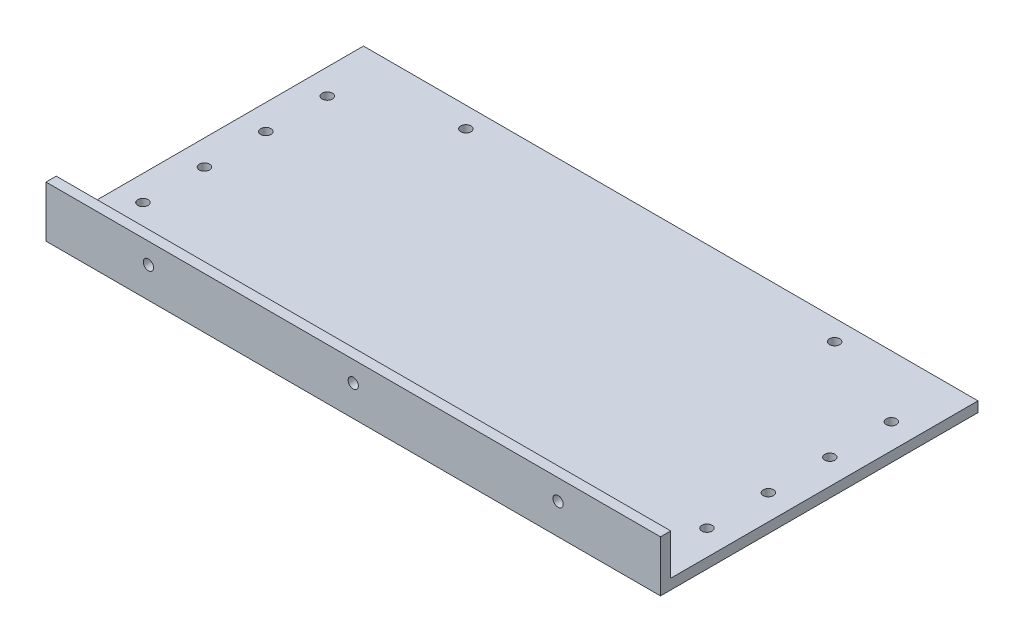
ISO-10303-21;
HEADER;
FILE_DESCRIPTION(('STEP AP214'),'2;1');
FILE_NAME('part.step','',(''),(''),'','','');
FILE_SCHEMA(('AUTOMOTIVE_DESIGN { 1 0 10303 214 1 1 1 1 }'));
ENDSEC;
DATA;
#1=APPLICATION_CONTEXT('core data for automotive mechanical design processes');
#2=APPLICATION_PROTOCOL_DEFINITION('international standard','automotive_design',2000,#1);
#3=PRODUCT_CONTEXT('',#1,'mechanical');
#4=PRODUCT('Part','Part','',(#3));
#5=PRODUCT_RELATED_PRODUCT_CATEGORY('part','',(#4));
#6=PRODUCT_DEFINITION_FORMATION('','',#4);
#7=PRODUCT_DEFINITION_CONTEXT('part definition',#1,'design');
#8=PRODUCT_DEFINITION('design','',#6,#7);
#9=PRODUCT_DEFINITION_SHAPE('','',#8);
#10=(LENGTH_UNIT() NAMED_UNIT(*) SI_UNIT(.MILLI.,.METRE.));
#11=(NAMED_UNIT(*) PLANE_ANGLE_UNIT() SI_UNIT($,.RADIAN.));
#12=(NAMED_UNIT(*) SI_UNIT($,.STERADIAN.) SOLID_ANGLE_UNIT());
#13=UNCERTAINTY_MEASURE_WITH_UNIT(LENGTH_MEASURE(1.E-05),#10,'distance_accuracy_value','');
#14=(GEOMETRIC_REPRESENTATION_CONTEXT(3) GLOBAL_UNCERTAINTY_ASSIGNED_CONTEXT((#13)) GLOBAL_UNIT_ASSIGNED_CONTEXT((#10,
#11,#12)) REPRESENTATION_CONTEXT('',''));
#15=CARTESIAN_POINT('',(0.,0.,0.));
#16=DIRECTION('',(0.,0.,1.));
#17=DIRECTION('',(1.,0.,0.));
#18=AXIS2_PLACEMENT_3D('',#15,#16,#17);
#19=CARTESIAN_POINT('',(-190.5,6.35,95.25));
#20=DIRECTION('',(1.,0.,0.));
#21=DIRECTION('',(0.,0.,-1.));
#22=AXIS2_PLACEMENT_3D('',#19,#20,#21);
#23=PLANE('',#22);
#24=DIRECTION('',(0.,0.,1.));
#25=VECTOR('',#24,1.);
#26=CARTESIAN_POINT('',(-190.5,0.,95.25));
#27=LINE('',#26,#25);
#28=CARTESIAN_POINT('',(-190.5,0.,-95.25));
#29=VERTEX_POINT('',#28);
#30=CARTESIAN_POINT('',(-190.5,0.,101.6));
#31=VERTEX_POINT('',#30);
#32=EDGE_CURVE('E103',#29,#31,#27,.T.);
#33=ORIENTED_EDGE('',*,*,#32,.T.);
#34=DIRECTION('',(0.,-1.,0.));
#35=VECTOR('',#34,1.);
#36=CARTESIAN_POINT('',(-190.5,0.,101.6));
#37=LINE('',#36,#35);
#38=CARTESIAN_POINT('',(-190.5,31.75,101.6));
#39=VERTEX_POINT('',#38);
#40=EDGE_CURVE('E127',#39,#31,#37,.T.);
#41=ORIENTED_EDGE('',*,*,#40,.F.);
#42=DIRECTION('',(0.,0.,-1.));
#43=VECTOR('',#42,1.);
#44=CARTESIAN_POINT('',(-190.5,31.75,101.6));
#45=LINE('',#44,#43);
#46=CARTESIAN_POINT('',(-190.5,31.75,95.25));
#47=VERTEX_POINT('',#46);
#48=EDGE_CURVE('E142',#39,#47,#45,.T.);
#49=ORIENTED_EDGE('',*,*,#48,.T.);
#50=DIRECTION('',(0.,-1.,0.));
#51=VECTOR('',#50,1.);
#52=CARTESIAN_POINT('',(-190.5,0.,95.25));
#53=LINE('',#52,#51);
#54=CARTESIAN_POINT('',(-190.5,6.35,95.25));
#55=VERTEX_POINT('',#54);
#56=EDGE_CURVE('E91',#47,#55,#53,.T.);
#57=ORIENTED_EDGE('',*,*,#56,.T.);
#58=DIRECTION('',(0.,0.,1.));
#59=VECTOR('',#58,1.);
#60=CARTESIAN_POINT('',(-190.5,6.35,95.25));
#61=LINE('',#60,#59);
#62=CARTESIAN_POINT('',(-190.5,6.35,-95.25));
#63=VERTEX_POINT('',#62);
#64=EDGE_CURVE('E96',#63,#55,#61,.T.);
#65=ORIENTED_EDGE('',*,*,#64,.F.);
#66=DIRECTION('',(0.,-1.,0.));
#67=VECTOR('',#66,1.);
#68=CARTESIAN_POINT('',(-190.5,6.35,-95.25));
#69=LINE('',#68,#67);
#70=EDGE_CURVE('E44',#63,#29,#69,.T.);
#71=ORIENTED_EDGE('',*,*,#70,.T.);
#72=EDGE_LOOP('',(#33,#41,#49,#57,#65,#71));
#73=FACE_BOUND('',#72,.T.);
#74=ADVANCED_FACE('F36',(#73),#23,.F.);
#75=CARTESIAN_POINT('',(190.5,6.35,95.25));
#76=DIRECTION('',(-1.,0.,0.));
#77=DIRECTION('',(0.,0.,1.));
#78=AXIS2_PLACEMENT_3D('',#75,#76,#77);
#79=PLANE('',#78);
#80=DIRECTION('',(0.,0.,-1.));
#81=VECTOR('',#80,1.);
#82=CARTESIAN_POINT('',(190.5,0.,95.25));
#83=LINE('',#82,#81);
#84=CARTESIAN_POINT('',(190.5,0.,101.6));
#85=VERTEX_POINT('',#84);
#86=CARTESIAN_POINT('',(190.5,0.,-95.25));
#87=VERTEX_POINT('',#86);
#88=EDGE_CURVE('E64',#85,#87,#83,.T.);
#89=ORIENTED_EDGE('',*,*,#88,.T.);
#90=DIRECTION('',(0.,-1.,0.));
#91=VECTOR('',#90,1.);
#92=CARTESIAN_POINT('',(190.5,6.35,-95.25));
#93=LINE('',#92,#91);
#94=CARTESIAN_POINT('',(190.5,6.35,-95.25));
#95=VERTEX_POINT('',#94);
#96=EDGE_CURVE('E11',#95,#87,#93,.T.);
#97=ORIENTED_EDGE('',*,*,#96,.F.);
#98=DIRECTION('',(0.,0.,-1.));
#99=VECTOR('',#98,1.);
#100=CARTESIAN_POINT('',(190.5,6.35,95.25));
#101=LINE('',#100,#99);
#102=CARTESIAN_POINT('',(190.5,6.35,95.25));
#103=VERTEX_POINT('',#102);
#104=EDGE_CURVE('E94',#103,#95,#101,.T.);
#105=ORIENTED_EDGE('',*,*,#104,.F.);
#106=DIRECTION('',(0.,1.,0.));
#107=VECTOR('',#106,1.);
#108=CARTESIAN_POINT('',(190.5,0.,95.25));
#109=LINE('',#108,#107);
#110=CARTESIAN_POINT('',(190.5,31.75,95.25));
#111=VERTEX_POINT('',#110);
#112=EDGE_CURVE('E83',#103,#111,#109,.T.);
#113=ORIENTED_EDGE('',*,*,#112,.T.);
#114=DIRECTION('',(0.,0.,-1.));
#115=VECTOR('',#114,1.);
#116=CARTESIAN_POINT('',(190.5,31.75,101.6));
#117=LINE('',#116,#115);
#118=CARTESIAN_POINT('',(190.5,31.75,101.6));
#119=VERTEX_POINT('',#118);
#120=EDGE_CURVE('E106',#119,#111,#117,.T.);
#121=ORIENTED_EDGE('',*,*,#120,.F.);
#122=DIRECTION('',(0.,1.,0.));
#123=VECTOR('',#122,1.);
#124=CARTESIAN_POINT('',(190.5,0.,101.6));
#125=LINE('',#124,#123);
#126=EDGE_CURVE('E126',#85,#119,#125,.T.);
#127=ORIENTED_EDGE('',*,*,#126,.F.);
#128=EDGE_LOOP('',(#89,#97,#105,#113,#121,#127));
#129=FACE_BOUND('',#128,.T.);
#130=ADVANCED_FACE('F98',(#129),#79,.F.);
#131=CARTESIAN_POINT('',(-190.5,6.35,-95.25));
#132=DIRECTION('',(0.,0.,1.));
#133=DIRECTION('',(1.,0.,0.));
#134=AXIS2_PLACEMENT_3D('',#131,#132,#133);
#135=PLANE('',#134);
#136=DIRECTION('',(-1.,0.,0.));
#137=VECTOR('',#136,1.);
#138=CARTESIAN_POINT('',(-190.5,0.,-95.25));
#139=LINE('',#138,#137);
#140=EDGE_CURVE('E108',#87,#29,#139,.T.);
#141=ORIENTED_EDGE('',*,*,#140,.T.);
#142=ORIENTED_EDGE('',*,*,#70,.F.);
#143=DIRECTION('',(-1.,0.,0.));
#144=VECTOR('',#143,1.);
#145=CARTESIAN_POINT('',(-190.5,6.35,-95.25));
#146=LINE('',#145,#144);
#147=EDGE_CURVE('E52',#95,#63,#146,.T.);
#148=ORIENTED_EDGE('',*,*,#147,.F.);
#149=ORIENTED_EDGE('',*,*,#96,.T.);
#150=EDGE_LOOP('',(#141,#142,#148,#149));
#151=FACE_BOUND('',#150,.T.);
#152=ADVANCED_FACE('F165',(#151),#135,.F.);
#153=CARTESIAN_POINT('',(0.,6.35,0.));
#154=DIRECTION('',(0.,-1.,0.));
#155=DIRECTION('',(0.,0.,-1.));
#156=AXIS2_PLACEMENT_3D('',#153,#154,#155);
#157=PLANE('',#156);
#158=CARTESIAN_POINT('',(174.8536,6.35,19.0500000000001));
#159=DIRECTION('',(0.,-1.,0.));
#160=DIRECTION('',(0.,0.,-1.));
#161=AXIS2_PLACEMENT_3D('',#158,#159,#160);
#162=CIRCLE('',#161,3.17499999999997);
#163=CARTESIAN_POINT('',(174.8536,6.35,15.8750000000001));
#164=VERTEX_POINT('',#163);
#165=EDGE_CURVE('E180',#164,#164,#162,.F.);
#166=ORIENTED_EDGE('',*,*,#165,.F.);
#167=EDGE_LOOP('',(#166));
#168=FACE_BOUND('',#167,.T.);
#169=CARTESIAN_POINT('',(-174.8536,6.35,19.0500000000001));
#170=DIRECTION('',(0.,-1.,0.));
#171=DIRECTION('',(0.,0.,-1.));
#172=AXIS2_PLACEMENT_3D('',#169,#170,#171);
#173=CIRCLE('',#172,3.17499999999997);
#174=CARTESIAN_POINT('',(-174.8536,6.35,15.8750000000001));
#175=VERTEX_POINT('',#174);
#176=EDGE_CURVE('E184',#175,#175,#173,.F.);
#177=ORIENTED_EDGE('',*,*,#176,.F.);
#178=EDGE_LOOP('',(#177));
#179=FACE_BOUND('',#178,.T.);
#180=CARTESIAN_POINT('',(-174.8536,6.35,-19.0499999999999));
#181=DIRECTION('',(0.,-1.,0.));
#182=DIRECTION('',(0.,0.,-1.));
#183=AXIS2_PLACEMENT_3D('',#180,#181,#182);
#184=CIRCLE('',#183,3.17499999999997);
#185=CARTESIAN_POINT('',(-174.8536,6.35,-22.2249999999999));
#186=VERTEX_POINT('',#185);
#187=EDGE_CURVE('E188',#186,#186,#184,.F.);
#188=ORIENTED_EDGE('',*,*,#187,.F.);
#189=EDGE_LOOP('',(#188));
#190=FACE_BOUND('',#189,.T.);
#191=CARTESIAN_POINT('',(174.8536,6.35,57.1500000000001));
#192=DIRECTION('',(0.,-1.,0.));
#193=DIRECTION('',(0.,0.,-1.));
#194=AXIS2_PLACEMENT_3D('',#191,#192,#193);
#195=CIRCLE('',#194,3.17499999999997);
#196=CARTESIAN_POINT('',(174.8536,6.35,53.9750000000001));
#197=VERTEX_POINT('',#196);
#198=EDGE_CURVE('E192',#197,#197,#195,.F.);
#199=ORIENTED_EDGE('',*,*,#198,.F.);
#200=EDGE_LOOP('',(#199));
#201=FACE_BOUND('',#200,.T.);
#202=CARTESIAN_POINT('',(174.8536,6.35,-19.0499999999999));
#203=DIRECTION('',(0.,-1.,0.));
#204=DIRECTION('',(0.,0.,-1.));
#205=AXIS2_PLACEMENT_3D('',#202,#203,#204);
#206=CIRCLE('',#205,3.17499999999997);
#207=CARTESIAN_POINT('',(174.8536,6.35,-22.2249999999999));
#208=VERTEX_POINT('',#207);
#209=EDGE_CURVE('E196',#208,#208,#206,.F.);
#210=ORIENTED_EDGE('',*,*,#209,.F.);
#211=EDGE_LOOP('',(#210));
#212=FACE_BOUND('',#211,.T.);
#213=CARTESIAN_POINT('',(174.8536,6.35,-57.1499999999999));
#214=DIRECTION('',(0.,-1.,0.));
#215=DIRECTION('',(0.,0.,-1.));
#216=AXIS2_PLACEMENT_3D('',#213,#214,#215);
#217=CIRCLE('',#216,3.17499999999997);
#218=CARTESIAN_POINT('',(174.8536,6.35,-60.3249999999999));
#219=VERTEX_POINT('',#218);
#220=EDGE_CURVE('E200',#219,#219,#217,.F.);
#221=ORIENTED_EDGE('',*,*,#220,.F.);
#222=EDGE_LOOP('',(#221));
#223=FACE_BOUND('',#222,.T.);
#224=CARTESIAN_POINT('',(-174.8536,6.35,57.1500000000001));
#225=DIRECTION('',(0.,-1.,0.));
#226=DIRECTION('',(0.,0.,-1.));
#227=AXIS2_PLACEMENT_3D('',#224,#225,#226);
#228=CIRCLE('',#227,3.17499999999997);
#229=CARTESIAN_POINT('',(-174.8536,6.35,53.9750000000001));
#230=VERTEX_POINT('',#229);
#231=EDGE_CURVE('E204',#230,#230,#228,.F.);
#232=ORIENTED_EDGE('',*,*,#231,.F.);
#233=EDGE_LOOP('',(#232));
#234=FACE_BOUND('',#233,.T.);
#235=CARTESIAN_POINT('',(-174.8536,6.35,-57.1499999999999));
#236=DIRECTION('',(0.,-1.,0.));
#237=DIRECTION('',(0.,0.,-1.));
#238=AXIS2_PLACEMENT_3D('',#235,#236,#237);
#239=CIRCLE('',#238,3.17499999999997);
#240=CARTESIAN_POINT('',(-174.8536,6.35,-60.3249999999999));
#241=VERTEX_POINT('',#240);
#242=EDGE_CURVE('E208',#241,#241,#239,.F.);
#243=ORIENTED_EDGE('',*,*,#242,.F.);
#244=EDGE_LOOP('',(#243));
#245=FACE_BOUND('',#244,.T.);
#246=CARTESIAN_POINT('',(114.3,6.35,-82.55));
#247=DIRECTION('',(0.,-1.,0.));
#248=DIRECTION('',(0.,0.,-1.));
#249=AXIS2_PLACEMENT_3D('',#246,#247,#248);
#250=CIRCLE('',#249,3.175);
#251=CARTESIAN_POINT('',(114.3,6.35,-85.725));
#252=VERTEX_POINT('',#251);
#253=EDGE_CURVE('E212',#252,#252,#250,.F.);
#254=ORIENTED_EDGE('',*,*,#253,.F.);
#255=EDGE_LOOP('',(#254));
#256=FACE_BOUND('',#255,.T.);
#257=CARTESIAN_POINT('',(-114.3,6.35,-82.55));
#258=DIRECTION('',(0.,-1.,0.));
#259=DIRECTION('',(0.,0.,-1.));
#260=AXIS2_PLACEMENT_3D('',#257,#258,#259);
#261=CIRCLE('',#260,3.175);
#262=CARTESIAN_POINT('',(-114.3,6.35,-85.725));
#263=VERTEX_POINT('',#262);
#264=EDGE_CURVE('E216',#263,#263,#261,.F.);
#265=ORIENTED_EDGE('',*,*,#264,.F.);
#266=EDGE_LOOP('',(#265));
#267=FACE_BOUND('',#266,.T.);
#268=CARTESIAN_POINT('',(114.3,6.35,82.55));
#269=DIRECTION('',(0.,-1.,0.));
#270=DIRECTION('',(0.,0.,-1.));
#271=AXIS2_PLACEMENT_3D('',#268,#269,#270);
#272=CIRCLE('',#271,3.175);
#273=CARTESIAN_POINT('',(114.3,6.35,79.375));
#274=VERTEX_POINT('',#273);
#275=EDGE_CURVE('E220',#274,#274,#272,.F.);
#276=ORIENTED_EDGE('',*,*,#275,.F.);
#277=EDGE_LOOP('',(#276));
#278=FACE_BOUND('',#277,.T.);
#279=CARTESIAN_POINT('',(-114.3,6.35,82.55));
#280=DIRECTION('',(0.,-1.,0.));
#281=DIRECTION('',(0.,0.,-1.));
#282=AXIS2_PLACEMENT_3D('',#279,#280,#281);
#283=CIRCLE('',#282,3.175);
#284=CARTESIAN_POINT('',(-114.3,6.35,79.375));
#285=VERTEX_POINT('',#284);
#286=EDGE_CURVE('E224',#285,#285,#283,.F.);
#287=ORIENTED_EDGE('',*,*,#286,.F.);
#288=EDGE_LOOP('',(#287));
#289=FACE_BOUND('',#288,.T.);
#290=CARTESIAN_POINT('',(0.,6.35,82.55));
#291=DIRECTION('',(0.,-1.,0.));
#292=DIRECTION('',(0.,0.,-1.));
#293=AXIS2_PLACEMENT_3D('',#290,#291,#292);
#294=CIRCLE('',#293,3.175);
#295=CARTESIAN_POINT('',(0.,6.35,79.375));
#296=VERTEX_POINT('',#295);
#297=EDGE_CURVE('E227',#296,#296,#294,.F.);
#298=ORIENTED_EDGE('',*,*,#297,.F.);
#299=EDGE_LOOP('',(#298));
#300=FACE_BOUND('',#299,.T.);
#301=ORIENTED_EDGE('',*,*,#64,.T.);
#302=DIRECTION('',(1.,0.,0.));
#303=VECTOR('',#302,1.);
#304=CARTESIAN_POINT('',(-190.5,6.35,95.25));
#305=LINE('',#304,#303);
#306=EDGE_CURVE('E73',#55,#103,#305,.T.);
#307=ORIENTED_EDGE('',*,*,#306,.T.);
#308=ORIENTED_EDGE('',*,*,#104,.T.);
#309=ORIENTED_EDGE('',*,*,#147,.T.);
#310=EDGE_LOOP('',(#301,#307,#308,#309));
#311=FACE_BOUND('',#310,.T.);
#312=ADVANCED_FACE('F93',(#168,#179,#190,#201,#212,#223,#234,#245,#256,#267,#278,#289,#300,
#311),#157,.F.);
#313=CARTESIAN_POINT('',(0.,0.,0.));
#314=DIRECTION('',(0.,-1.,0.));
#315=DIRECTION('',(0.,0.,-1.));
#316=AXIS2_PLACEMENT_3D('',#313,#314,#315);
#317=PLANE('',#316);
#318=CARTESIAN_POINT('',(174.8536,0.,19.0500000000001));
#319=DIRECTION('',(0.,-1.,0.));
#320=DIRECTION('',(0.,0.,-1.));
#321=AXIS2_PLACEMENT_3D('',#318,#319,#320);
#322=CIRCLE('',#321,3.17499999999997);
#323=CARTESIAN_POINT('',(174.8536,0.,15.8750000000001));
#324=VERTEX_POINT('',#323);
#325=EDGE_CURVE('E325',#324,#324,#322,.T.);
#326=ORIENTED_EDGE('',*,*,#325,.F.);
#327=EDGE_LOOP('',(#326));
#328=FACE_BOUND('',#327,.T.);
#329=CARTESIAN_POINT('',(-174.8536,0.,19.0500000000001));
#330=DIRECTION('',(0.,-1.,0.));
#331=DIRECTION('',(0.,0.,1.));
#332=AXIS2_PLACEMENT_3D('',#329,#330,#331);
#333=CIRCLE('',#332,3.17499999999997);
#334=CARTESIAN_POINT('',(-174.8536,0.,22.2250000000001));
#335=VERTEX_POINT('',#334);
#336=EDGE_CURVE('E336',#335,#335,#333,.T.);
#337=ORIENTED_EDGE('',*,*,#336,.F.);
#338=EDGE_LOOP('',(#337));
#339=FACE_BOUND('',#338,.T.);
#340=CARTESIAN_POINT('',(-174.8536,0.,-19.0499999999999));
#341=DIRECTION('',(0.,-1.,0.));
#342=DIRECTION('',(0.,0.,1.));
#343=AXIS2_PLACEMENT_3D('',#340,#341,#342);
#344=CIRCLE('',#343,3.17499999999997);
#345=CARTESIAN_POINT('',(-174.8536,0.,-15.875));
#346=VERTEX_POINT('',#345);
#347=EDGE_CURVE('E340',#346,#346,#344,.T.);
#348=ORIENTED_EDGE('',*,*,#347,.F.);
#349=EDGE_LOOP('',(#348));
#350=FACE_BOUND('',#349,.T.);
#351=CARTESIAN_POINT('',(174.8536,0.,57.1500000000001));
#352=DIRECTION('',(0.,-1.,0.));
#353=DIRECTION('',(0.,0.,-1.));
#354=AXIS2_PLACEMENT_3D('',#351,#352,#353);
#355=CIRCLE('',#354,3.17499999999997);
#356=CARTESIAN_POINT('',(174.8536,0.,53.9750000000001));
#357=VERTEX_POINT('',#356);
#358=EDGE_CURVE('E344',#357,#357,#355,.T.);
#359=ORIENTED_EDGE('',*,*,#358,.F.);
#360=EDGE_LOOP('',(#359));
#361=FACE_BOUND('',#360,.T.);
#362=CARTESIAN_POINT('',(174.8536,0.,-19.0499999999999));
#363=DIRECTION('',(0.,-1.,0.));
#364=DIRECTION('',(0.,0.,-1.));
#365=AXIS2_PLACEMENT_3D('',#362,#363,#364);
#366=CIRCLE('',#365,3.17499999999997);
#367=CARTESIAN_POINT('',(174.8536,0.,-22.2249999999999));
#368=VERTEX_POINT('',#367);
#369=EDGE_CURVE('E322',#368,#368,#366,.T.);
#370=ORIENTED_EDGE('',*,*,#369,.F.);
#371=EDGE_LOOP('',(#370));
#372=FACE_BOUND('',#371,.T.);
#373=CARTESIAN_POINT('',(174.8536,0.,-57.1499999999999));
#374=DIRECTION('',(0.,-1.,0.));
#375=DIRECTION('',(0.,0.,-1.));
#376=AXIS2_PLACEMENT_3D('',#373,#374,#375);
#377=CIRCLE('',#376,3.17499999999997);
#378=CARTESIAN_POINT('',(174.8536,0.,-60.3249999999999));
#379=VERTEX_POINT('',#378);
#380=EDGE_CURVE('E327',#379,#379,#377,.T.);
#381=ORIENTED_EDGE('',*,*,#380,.F.);
#382=EDGE_LOOP('',(#381));
#383=FACE_BOUND('',#382,.T.);
#384=CARTESIAN_POINT('',(-174.8536,0.,57.1500000000001));
#385=DIRECTION('',(0.,-1.,0.));
#386=DIRECTION('',(0.,0.,1.));
#387=AXIS2_PLACEMENT_3D('',#384,#385,#386);
#388=CIRCLE('',#387,3.17499999999997);
#389=CARTESIAN_POINT('',(-174.8536,0.,60.3250000000001));
#390=VERTEX_POINT('',#389);
#391=EDGE_CURVE('E332',#390,#390,#388,.T.);
#392=ORIENTED_EDGE('',*,*,#391,.F.);
#393=EDGE_LOOP('',(#392));
#394=FACE_BOUND('',#393,.T.);
#395=CARTESIAN_POINT('',(-174.8536,0.,-57.1499999999999));
#396=DIRECTION('',(0.,-1.,0.));
#397=DIRECTION('',(0.,0.,1.));
#398=AXIS2_PLACEMENT_3D('',#395,#396,#397);
#399=CIRCLE('',#398,3.17499999999997);
#400=CARTESIAN_POINT('',(-174.8536,0.,-53.975));
#401=VERTEX_POINT('',#400);
#402=EDGE_CURVE('E348',#401,#401,#399,.T.);
#403=ORIENTED_EDGE('',*,*,#402,.F.);
#404=EDGE_LOOP('',(#403));
#405=FACE_BOUND('',#404,.T.);
#406=CARTESIAN_POINT('',(114.3,0.,-82.55));
#407=DIRECTION('',(0.,-1.,0.));
#408=DIRECTION('',(0.,0.,-1.));
#409=AXIS2_PLACEMENT_3D('',#406,#407,#408);
#410=CIRCLE('',#409,3.175);
#411=CARTESIAN_POINT('',(114.3,0.,-85.725));
#412=VERTEX_POINT('',#411);
#413=EDGE_CURVE('E355',#412,#412,#410,.T.);
#414=ORIENTED_EDGE('',*,*,#413,.F.);
#415=EDGE_LOOP('',(#414));
#416=FACE_BOUND('',#415,.T.);
#417=CARTESIAN_POINT('',(-114.3,0.,-82.55));
#418=DIRECTION('',(0.,-1.,0.));
#419=DIRECTION('',(0.,0.,-1.));
#420=AXIS2_PLACEMENT_3D('',#417,#418,#419);
#421=CIRCLE('',#420,3.175);
#422=CARTESIAN_POINT('',(-114.3,0.,-85.725));
#423=VERTEX_POINT('',#422);
#424=EDGE_CURVE('E364',#423,#423,#421,.T.);
#425=ORIENTED_EDGE('',*,*,#424,.F.);
#426=EDGE_LOOP('',(#425));
#427=FACE_BOUND('',#426,.T.);
#428=CARTESIAN_POINT('',(114.3,0.,82.55));
#429=DIRECTION('',(0.,-1.,0.));
#430=DIRECTION('',(0.,0.,-1.));
#431=AXIS2_PLACEMENT_3D('',#428,#429,#430);
#432=CIRCLE('',#431,3.175);
#433=CARTESIAN_POINT('',(114.3,0.,79.375));
#434=VERTEX_POINT('',#433);
#435=EDGE_CURVE('E360',#434,#434,#432,.T.);
#436=ORIENTED_EDGE('',*,*,#435,.F.);
#437=EDGE_LOOP('',(#436));
#438=FACE_BOUND('',#437,.T.);
#439=CARTESIAN_POINT('',(-114.3,0.,82.55));
#440=DIRECTION('',(0.,-1.,0.));
#441=DIRECTION('',(0.,0.,-1.));
#442=AXIS2_PLACEMENT_3D('',#439,#440,#441);
#443=CIRCLE('',#442,3.175);
#444=CARTESIAN_POINT('',(-114.3,0.,79.375));
#445=VERTEX_POINT('',#444);
#446=EDGE_CURVE('E356',#445,#445,#443,.T.);
#447=ORIENTED_EDGE('',*,*,#446,.F.);
#448=EDGE_LOOP('',(#447));
#449=FACE_BOUND('',#448,.T.);
#450=CARTESIAN_POINT('',(0.,0.,82.55));
#451=DIRECTION('',(0.,-1.,0.));
#452=DIRECTION('',(0.,0.,-1.));
#453=AXIS2_PLACEMENT_3D('',#450,#451,#452);
#454=CIRCLE('',#453,3.175);
#455=CARTESIAN_POINT('',(0.,0.,79.375));
#456=VERTEX_POINT('',#455);
#457=EDGE_CURVE('E230',#456,#456,#454,.T.);
#458=ORIENTED_EDGE('',*,*,#457,.F.);
#459=EDGE_LOOP('',(#458));
#460=FACE_BOUND('',#459,.T.);
#461=ORIENTED_EDGE('',*,*,#32,.F.);
#462=ORIENTED_EDGE('',*,*,#140,.F.);
#463=ORIENTED_EDGE('',*,*,#88,.F.);
#464=DIRECTION('',(1.,0.,0.));
#465=VECTOR('',#464,1.);
#466=CARTESIAN_POINT('',(-190.5,0.,101.6));
#467=LINE('',#466,#465);
#468=EDGE_CURVE('E120',#31,#85,#467,.T.);
#469=ORIENTED_EDGE('',*,*,#468,.F.);
#470=EDGE_LOOP('',(#461,#462,#463,#469));
#471=FACE_BOUND('',#470,.T.);
#472=ADVANCED_FACE('F118',(#328,#339,#350,#361,#372,#383,#394,#405,#416,#427,#438,#449,#460,
#471),#317,.T.);
#473=CARTESIAN_POINT('',(0.,0.,95.25));
#474=DIRECTION('',(0.,0.,-1.));
#475=DIRECTION('',(-1.,0.,0.));
#476=AXIS2_PLACEMENT_3D('',#473,#474,#475);
#477=PLANE('',#476);
#478=CARTESIAN_POINT('',(127.,19.05,95.25));
#479=DIRECTION('',(0.,0.,-1.));
#480=DIRECTION('',(-1.,0.,0.));
#481=AXIS2_PLACEMENT_3D('',#478,#479,#480);
#482=CIRCLE('',#481,3.175);
#483=CARTESIAN_POINT('',(123.825,19.05,95.25));
#484=VERTEX_POINT('',#483);
#485=EDGE_CURVE('E233',#484,#484,#482,.F.);
#486=ORIENTED_EDGE('',*,*,#485,.T.);
#487=EDGE_LOOP('',(#486));
#488=FACE_BOUND('',#487,.T.);
#489=CARTESIAN_POINT('',(-127.,19.05,95.25));
#490=DIRECTION('',(0.,0.,-1.));
#491=DIRECTION('',(-1.,0.,0.));
#492=AXIS2_PLACEMENT_3D('',#489,#490,#491);
#493=CIRCLE('',#492,3.175);
#494=CARTESIAN_POINT('',(-130.175,19.05,95.25));
#495=VERTEX_POINT('',#494);
#496=EDGE_CURVE('E242',#495,#495,#493,.F.);
#497=ORIENTED_EDGE('',*,*,#496,.T.);
#498=EDGE_LOOP('',(#497));
#499=FACE_BOUND('',#498,.T.);
#500=CARTESIAN_POINT('',(0.,19.05,95.25));
#501=DIRECTION('',(0.,0.,-1.));
#502=DIRECTION('',(-1.,0.,0.));
#503=AXIS2_PLACEMENT_3D('',#500,#501,#502);
#504=CIRCLE('',#503,3.175);
#505=CARTESIAN_POINT('',(-3.175,19.05,95.25));
#506=VERTEX_POINT('',#505);
#507=EDGE_CURVE('E137',#506,#506,#504,.F.);
#508=ORIENTED_EDGE('',*,*,#507,.T.);
#509=EDGE_LOOP('',(#508));
#510=FACE_BOUND('',#509,.T.);
#511=ORIENTED_EDGE('',*,*,#306,.F.);
#512=ORIENTED_EDGE('',*,*,#56,.F.);
#513=DIRECTION('',(-1.,0.,0.));
#514=VECTOR('',#513,1.);
#515=CARTESIAN_POINT('',(-190.5,31.75,95.25));
#516=LINE('',#515,#514);
#517=EDGE_CURVE('E87',#111,#47,#516,.T.);
#518=ORIENTED_EDGE('',*,*,#517,.F.);
#519=ORIENTED_EDGE('',*,*,#112,.F.);
#520=EDGE_LOOP('',(#511,#512,#518,#519));
#521=FACE_BOUND('',#520,.T.);
#522=ADVANCED_FACE('F84',(#488,#499,#510,#521),#477,.T.);
#523=CARTESIAN_POINT('',(-190.5,31.75,101.6));
#524=DIRECTION('',(0.,-1.,0.));
#525=DIRECTION('',(0.,0.,-1.));
#526=AXIS2_PLACEMENT_3D('',#523,#524,#525);
#527=PLANE('',#526);
#528=ORIENTED_EDGE('',*,*,#517,.T.);
#529=ORIENTED_EDGE('',*,*,#48,.F.);
#530=DIRECTION('',(-1.,0.,0.));
#531=VECTOR('',#530,1.);
#532=CARTESIAN_POINT('',(-190.5,31.75,101.6));
#533=LINE('',#532,#531);
#534=EDGE_CURVE('E131',#119,#39,#533,.T.);
#535=ORIENTED_EDGE('',*,*,#534,.F.);
#536=ORIENTED_EDGE('',*,*,#120,.T.);
#537=EDGE_LOOP('',(#528,#529,#535,#536));
#538=FACE_BOUND('',#537,.T.);
#539=ADVANCED_FACE('F146',(#538),#527,.F.);
#540=CARTESIAN_POINT('',(0.,0.,101.6));
#541=DIRECTION('',(0.,0.,-1.));
#542=DIRECTION('',(-1.,0.,0.));
#543=AXIS2_PLACEMENT_3D('',#540,#541,#542);
#544=PLANE('',#543);
#545=CARTESIAN_POINT('',(127.,19.05,101.6));
#546=DIRECTION('',(0.,0.,1.));
#547=DIRECTION('',(1.,0.,0.));
#548=AXIS2_PLACEMENT_3D('',#545,#546,#547);
#549=CIRCLE('',#548,3.175);
#550=CARTESIAN_POINT('',(130.175,19.05,101.6));
#551=VERTEX_POINT('',#550);
#552=EDGE_CURVE('E229',#551,#551,#549,.T.);
#553=ORIENTED_EDGE('',*,*,#552,.F.);
#554=EDGE_LOOP('',(#553));
#555=FACE_BOUND('',#554,.T.);
#556=CARTESIAN_POINT('',(-127.,19.05,101.6));
#557=DIRECTION('',(0.,0.,1.));
#558=DIRECTION('',(1.,0.,0.));
#559=AXIS2_PLACEMENT_3D('',#556,#557,#558);
#560=CIRCLE('',#559,3.175);
#561=CARTESIAN_POINT('',(-123.825,19.05,101.6));
#562=VERTEX_POINT('',#561);
#563=EDGE_CURVE('E239',#562,#562,#560,.T.);
#564=ORIENTED_EDGE('',*,*,#563,.F.);
#565=EDGE_LOOP('',(#564));
#566=FACE_BOUND('',#565,.T.);
#567=CARTESIAN_POINT('',(0.,19.05,101.6));
#568=DIRECTION('',(0.,0.,1.));
#569=DIRECTION('',(1.,0.,0.));
#570=AXIS2_PLACEMENT_3D('',#567,#568,#569);
#571=CIRCLE('',#570,3.175);
#572=CARTESIAN_POINT('',(3.175,19.05,101.6));
#573=VERTEX_POINT('',#572);
#574=EDGE_CURVE('E244',#573,#573,#571,.T.);
#575=ORIENTED_EDGE('',*,*,#574,.F.);
#576=EDGE_LOOP('',(#575));
#577=FACE_BOUND('',#576,.T.);
#578=ORIENTED_EDGE('',*,*,#40,.T.);
#579=ORIENTED_EDGE('',*,*,#468,.T.);
#580=ORIENTED_EDGE('',*,*,#126,.T.);
#581=ORIENTED_EDGE('',*,*,#534,.T.);
#582=EDGE_LOOP('',(#578,#579,#580,#581));
#583=FACE_BOUND('',#582,.T.);
#584=ADVANCED_FACE('F129',(#555,#566,#577,#583),#544,.F.);
#585=CARTESIAN_POINT('',(0.,19.05,86.2697438789309));
#586=DIRECTION('',(0.,0.,1.));
#587=DIRECTION('',(1.,0.,0.));
#588=AXIS2_PLACEMENT_3D('',#585,#586,#587);
#589=CYLINDRICAL_SURFACE('',#588,3.175);
#590=ORIENTED_EDGE('',*,*,#574,.T.);
#591=EDGE_LOOP('',(#590));
#592=FACE_BOUND('',#591,.T.);
#593=ORIENTED_EDGE('',*,*,#507,.F.);
#594=EDGE_LOOP('',(#593));
#595=FACE_BOUND('',#594,.T.);
#596=ADVANCED_FACE('F155',(#592,#595),#589,.F.);
#597=CARTESIAN_POINT('',(-127.,19.05,86.2697438789309));
#598=DIRECTION('',(0.,0.,1.));
#599=DIRECTION('',(1.,0.,0.));
#600=AXIS2_PLACEMENT_3D('',#597,#598,#599);
#601=CYLINDRICAL_SURFACE('',#600,3.175);
#602=ORIENTED_EDGE('',*,*,#563,.T.);
#603=EDGE_LOOP('',(#602));
#604=FACE_BOUND('',#603,.T.);
#605=ORIENTED_EDGE('',*,*,#496,.F.);
#606=EDGE_LOOP('',(#605));
#607=FACE_BOUND('',#606,.T.);
#608=ADVANCED_FACE('F255',(#604,#607),#601,.F.);
#609=CARTESIAN_POINT('',(127.,19.05,86.2697438789309));
#610=DIRECTION('',(0.,0.,1.));
#611=DIRECTION('',(1.,0.,0.));
#612=AXIS2_PLACEMENT_3D('',#609,#610,#611);
#613=CYLINDRICAL_SURFACE('',#612,3.175);
#614=ORIENTED_EDGE('',*,*,#552,.T.);
#615=EDGE_LOOP('',(#614));
#616=FACE_BOUND('',#615,.T.);
#617=ORIENTED_EDGE('',*,*,#485,.F.);
#618=EDGE_LOOP('',(#617));
#619=FACE_BOUND('',#618,.T.);
#620=ADVANCED_FACE('F260',(#616,#619),#613,.F.);
#621=CARTESIAN_POINT('',(0.,15.3302561210691,82.55));
#622=DIRECTION('',(0.,-1.,0.));
#623=DIRECTION('',(0.,0.,-1.));
#624=AXIS2_PLACEMENT_3D('',#621,#622,#623);
#625=CYLINDRICAL_SURFACE('',#624,3.175);
#626=ORIENTED_EDGE('',*,*,#297,.T.);
#627=EDGE_LOOP('',(#626));
#628=FACE_BOUND('',#627,.T.);
#629=ORIENTED_EDGE('',*,*,#457,.T.);
#630=EDGE_LOOP('',(#629));
#631=FACE_BOUND('',#630,.T.);
#632=ADVANCED_FACE('F265',(#628,#631),#625,.F.);
#633=CARTESIAN_POINT('',(-114.3,15.3302561210691,82.55));
#634=DIRECTION('',(0.,-1.,0.));
#635=DIRECTION('',(0.,0.,-1.));
#636=AXIS2_PLACEMENT_3D('',#633,#634,#635);
#637=CYLINDRICAL_SURFACE('',#636,3.175);
#638=ORIENTED_EDGE('',*,*,#286,.T.);
#639=EDGE_LOOP('',(#638));
#640=FACE_BOUND('',#639,.T.);
#641=ORIENTED_EDGE('',*,*,#446,.T.);
#642=EDGE_LOOP('',(#641));
#643=FACE_BOUND('',#642,.T.);
#644=ADVANCED_FACE('F270',(#640,#643),#637,.F.);
#645=CARTESIAN_POINT('',(114.3,15.3302561210691,82.55));
#646=DIRECTION('',(0.,-1.,0.));
#647=DIRECTION('',(0.,0.,-1.));
#648=AXIS2_PLACEMENT_3D('',#645,#646,#647);
#649=CYLINDRICAL_SURFACE('',#648,3.175);
#650=ORIENTED_EDGE('',*,*,#275,.T.);
#651=EDGE_LOOP('',(#650));
#652=FACE_BOUND('',#651,.T.);
#653=ORIENTED_EDGE('',*,*,#435,.T.);
#654=EDGE_LOOP('',(#653));
#655=FACE_BOUND('',#654,.T.);
#656=ADVANCED_FACE('F279',(#652,#655),#649,.F.);
#657=CARTESIAN_POINT('',(-114.3,15.3302561210691,-82.55));
#658=DIRECTION('',(0.,-1.,0.));
#659=DIRECTION('',(0.,0.,-1.));
#660=AXIS2_PLACEMENT_3D('',#657,#658,#659);
#661=CYLINDRICAL_SURFACE('',#660,3.175);
#662=ORIENTED_EDGE('',*,*,#264,.T.);
#663=EDGE_LOOP('',(#662));
#664=FACE_BOUND('',#663,.T.);
#665=ORIENTED_EDGE('',*,*,#424,.T.);
#666=EDGE_LOOP('',(#665));
#667=FACE_BOUND('',#666,.T.);
#668=ADVANCED_FACE('F275',(#664,#667),#661,.F.);
#669=CARTESIAN_POINT('',(114.3,15.3302561210691,-82.55));
#670=DIRECTION('',(0.,-1.,0.));
#671=DIRECTION('',(0.,0.,-1.));
#672=AXIS2_PLACEMENT_3D('',#669,#670,#671);
#673=CYLINDRICAL_SURFACE('',#672,3.175);
#674=ORIENTED_EDGE('',*,*,#253,.T.);
#675=EDGE_LOOP('',(#674));
#676=FACE_BOUND('',#675,.T.);
#677=ORIENTED_EDGE('',*,*,#413,.T.);
#678=EDGE_LOOP('',(#677));
#679=FACE_BOUND('',#678,.T.);
#680=ADVANCED_FACE('F271',(#676,#679),#673,.F.);
#681=CARTESIAN_POINT('',(-174.8536,15.3302561210691,-57.1499999999999));
#682=DIRECTION('',(0.,-1.,0.));
#683=DIRECTION('',(0.,0.,-1.));
#684=AXIS2_PLACEMENT_3D('',#681,#682,#683);
#685=CYLINDRICAL_SURFACE('',#684,3.17499999999997);
#686=ORIENTED_EDGE('',*,*,#242,.T.);
#687=EDGE_LOOP('',(#686));
#688=FACE_BOUND('',#687,.T.);
#689=ORIENTED_EDGE('',*,*,#402,.T.);
#690=EDGE_LOOP('',(#689));
#691=FACE_BOUND('',#690,.T.);
#692=ADVANCED_FACE('F274',(#688,#691),#685,.F.);
#693=CARTESIAN_POINT('',(-174.8536,15.3302561210691,57.1500000000001));
#694=DIRECTION('',(0.,-1.,0.));
#695=DIRECTION('',(0.,0.,-1.));
#696=AXIS2_PLACEMENT_3D('',#693,#694,#695);
#697=CYLINDRICAL_SURFACE('',#696,3.17499999999997);
#698=ORIENTED_EDGE('',*,*,#231,.T.);
#699=EDGE_LOOP('',(#698));
#700=FACE_BOUND('',#699,.T.);
#701=ORIENTED_EDGE('',*,*,#391,.T.);
#702=EDGE_LOOP('',(#701));
#703=FACE_BOUND('',#702,.T.);
#704=ADVANCED_FACE('F289',(#700,#703),#697,.F.);
#705=CARTESIAN_POINT('',(174.8536,15.3302561210691,-57.1499999999999));
#706=DIRECTION('',(0.,-1.,0.));
#707=DIRECTION('',(0.,0.,-1.));
#708=AXIS2_PLACEMENT_3D('',#705,#706,#707);
#709=CYLINDRICAL_SURFACE('',#708,3.17499999999997);
#710=ORIENTED_EDGE('',*,*,#220,.T.);
#711=EDGE_LOOP('',(#710));
#712=FACE_BOUND('',#711,.T.);
#713=ORIENTED_EDGE('',*,*,#380,.T.);
#714=EDGE_LOOP('',(#713));
#715=FACE_BOUND('',#714,.T.);
#716=ADVANCED_FACE('F310',(#712,#715),#709,.F.);
#717=CARTESIAN_POINT('',(174.8536,15.3302561210691,-19.0499999999999));
#718=DIRECTION('',(0.,-1.,0.));
#719=DIRECTION('',(0.,0.,-1.));
#720=AXIS2_PLACEMENT_3D('',#717,#718,#719);
#721=CYLINDRICAL_SURFACE('',#720,3.17499999999997);
#722=ORIENTED_EDGE('',*,*,#209,.T.);
#723=EDGE_LOOP('',(#722));
#724=FACE_BOUND('',#723,.T.);
#725=ORIENTED_EDGE('',*,*,#369,.T.);
#726=EDGE_LOOP('',(#725));
#727=FACE_BOUND('',#726,.T.);
#728=ADVANCED_FACE('F299',(#724,#727),#721,.F.);
#729=CARTESIAN_POINT('',(174.8536,15.3302561210691,57.1500000000001));
#730=DIRECTION('',(0.,-1.,0.));
#731=DIRECTION('',(0.,0.,-1.));
#732=AXIS2_PLACEMENT_3D('',#729,#730,#731);
#733=CYLINDRICAL_SURFACE('',#732,3.17499999999997);
#734=ORIENTED_EDGE('',*,*,#198,.T.);
#735=EDGE_LOOP('',(#734));
#736=FACE_BOUND('',#735,.T.);
#737=ORIENTED_EDGE('',*,*,#358,.T.);
#738=EDGE_LOOP('',(#737));
#739=FACE_BOUND('',#738,.T.);
#740=ADVANCED_FACE('F295',(#736,#739),#733,.F.);
#741=CARTESIAN_POINT('',(-174.8536,15.3302561210691,-19.0499999999999));
#742=DIRECTION('',(0.,-1.,0.));
#743=DIRECTION('',(0.,0.,-1.));
#744=AXIS2_PLACEMENT_3D('',#741,#742,#743);
#745=CYLINDRICAL_SURFACE('',#744,3.17499999999997);
#746=ORIENTED_EDGE('',*,*,#187,.T.);
#747=EDGE_LOOP('',(#746));
#748=FACE_BOUND('',#747,.T.);
#749=ORIENTED_EDGE('',*,*,#347,.T.);
#750=EDGE_LOOP('',(#749));
#751=FACE_BOUND('',#750,.T.);
#752=ADVANCED_FACE('F291',(#748,#751),#745,.F.);
#753=CARTESIAN_POINT('',(-174.8536,15.3302561210691,19.0500000000001));
#754=DIRECTION('',(0.,-1.,0.));
#755=DIRECTION('',(0.,0.,-1.));
#756=AXIS2_PLACEMENT_3D('',#753,#754,#755);
#757=CYLINDRICAL_SURFACE('',#756,3.17499999999997);
#758=ORIENTED_EDGE('',*,*,#176,.T.);
#759=EDGE_LOOP('',(#758));
#760=FACE_BOUND('',#759,.T.);
#761=ORIENTED_EDGE('',*,*,#336,.T.);
#762=EDGE_LOOP('',(#761));
#763=FACE_BOUND('',#762,.T.);
#764=ADVANCED_FACE('F294',(#760,#763),#757,.F.);
#765=CARTESIAN_POINT('',(174.8536,15.3302561210691,19.0500000000001));
#766=DIRECTION('',(0.,-1.,0.));
#767=DIRECTION('',(0.,0.,-1.));
#768=AXIS2_PLACEMENT_3D('',#765,#766,#767);
#769=CYLINDRICAL_SURFACE('',#768,3.17499999999997);
#770=ORIENTED_EDGE('',*,*,#165,.T.);
#771=EDGE_LOOP('',(#770));
#772=FACE_BOUND('',#771,.T.);
#773=ORIENTED_EDGE('',*,*,#325,.T.);
#774=EDGE_LOOP('',(#773));
#775=FACE_BOUND('',#774,.T.);
#776=ADVANCED_FACE('F301',(#772,#775),#769,.F.);
#777=CLOSED_SHELL('',(#74,#130,#152,#312,#472,#522,#539,#584,#596,#608,#620,#632,#644,#656,#668,
#680,#692,#704,#716,#728,#740,#752,#764,#776));
#778=MANIFOLD_SOLID_BREP('B2',#777);
#779=ADVANCED_BREP_SHAPE_REPRESENTATION('',(#18,#778),#14);
#780=SHAPE_DEFINITION_REPRESENTATION(#9,#779);
ENDSEC;
END-ISO-10303-21;
